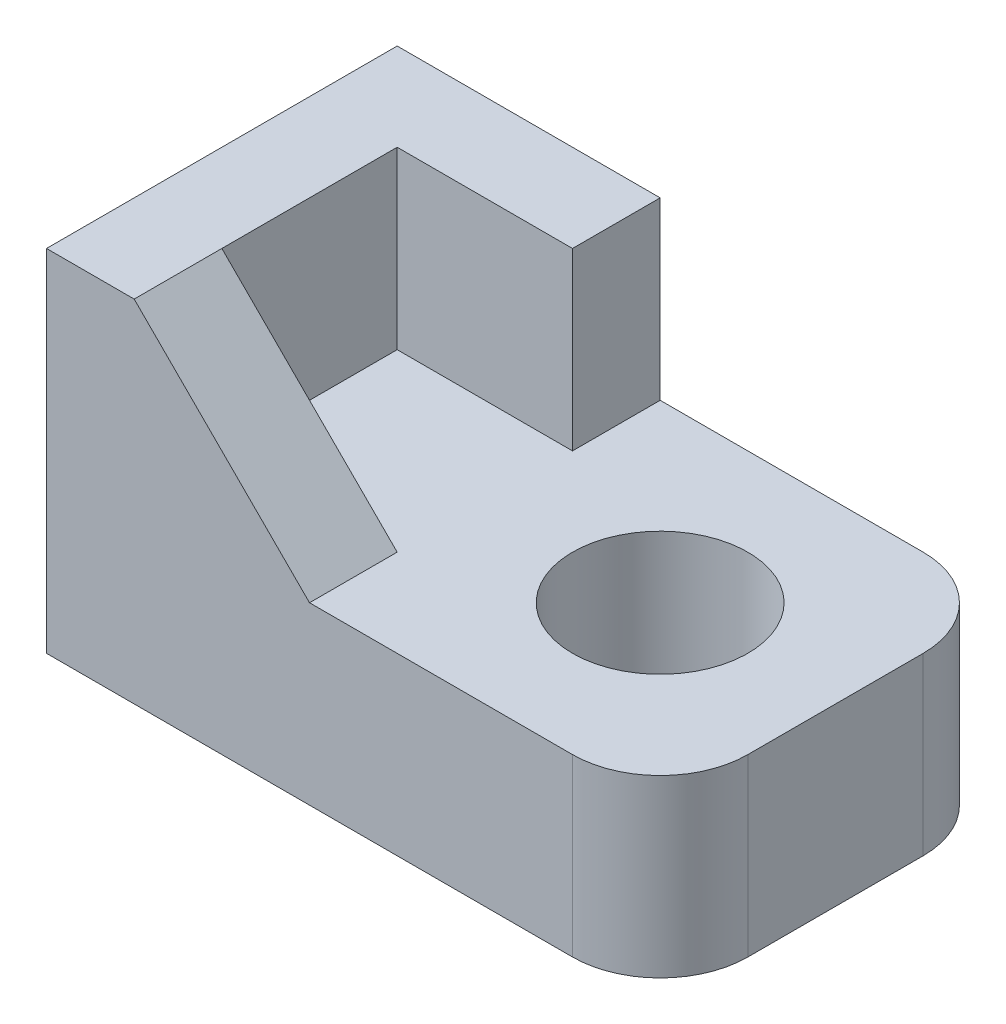
ISO-10303-21;
HEADER;
FILE_DESCRIPTION(('STEP AP214'),'2;1');
FILE_NAME('part.step','',(''),(''),'','','');
FILE_SCHEMA(('AUTOMOTIVE_DESIGN { 1 0 10303 214 1 1 1 1 }'));
ENDSEC;
DATA;
#1=APPLICATION_CONTEXT('core data for automotive mechanical design processes');
#2=APPLICATION_PROTOCOL_DEFINITION('international standard','automotive_design',2000,#1);
#3=PRODUCT_CONTEXT('',#1,'mechanical');
#4=PRODUCT('Part','Part','',(#3));
#5=PRODUCT_RELATED_PRODUCT_CATEGORY('part','',(#4));
#6=PRODUCT_DEFINITION_FORMATION('','',#4);
#7=PRODUCT_DEFINITION_CONTEXT('part definition',#1,'design');
#8=PRODUCT_DEFINITION('design','',#6,#7);
#9=PRODUCT_DEFINITION_SHAPE('','',#8);
#10=(LENGTH_UNIT() NAMED_UNIT(*) SI_UNIT(.MILLI.,.METRE.));
#11=(NAMED_UNIT(*) PLANE_ANGLE_UNIT() SI_UNIT($,.RADIAN.));
#12=(NAMED_UNIT(*) SI_UNIT($,.STERADIAN.) SOLID_ANGLE_UNIT());
#13=UNCERTAINTY_MEASURE_WITH_UNIT(LENGTH_MEASURE(1.E-05),#10,'distance_accuracy_value','');
#14=(GEOMETRIC_REPRESENTATION_CONTEXT(3) GLOBAL_UNCERTAINTY_ASSIGNED_CONTEXT((#13)) GLOBAL_UNIT_ASSIGNED_CONTEXT((#10,
#11,#12)) REPRESENTATION_CONTEXT('',''));
#15=CARTESIAN_POINT('',(0.,0.,0.));
#16=DIRECTION('',(0.,0.,1.));
#17=DIRECTION('',(1.,0.,0.));
#18=AXIS2_PLACEMENT_3D('',#15,#16,#17);
#19=CARTESIAN_POINT('',(30.,10.,-5.));
#20=DIRECTION('',(0.,1.,0.));
#21=DIRECTION('',(0.,0.,1.));
#22=AXIS2_PLACEMENT_3D('',#19,#20,#21);
#23=PLANE('',#22);
#24=DIRECTION('',(0.,0.,-1.));
#25=VECTOR('',#24,1.);
#26=CARTESIAN_POINT('',(15.,10.,-5.));
#27=LINE('',#26,#25);
#28=CARTESIAN_POINT('',(15.,10.,10.));
#29=VERTEX_POINT('',#28);
#30=CARTESIAN_POINT('',(15.,10.,5.));
#31=VERTEX_POINT('',#30);
#32=EDGE_CURVE('E117',#29,#31,#27,.T.);
#33=ORIENTED_EDGE('',*,*,#32,.F.);
#34=DIRECTION('',(1.,0.,0.));
#35=VECTOR('',#34,1.);
#36=CARTESIAN_POINT('',(0.,10.,10.));
#37=LINE('',#36,#35);
#38=CARTESIAN_POINT('',(30.,10.,10.));
#39=VERTEX_POINT('',#38);
#40=EDGE_CURVE('E150',#29,#39,#37,.T.);
#41=ORIENTED_EDGE('',*,*,#40,.T.);
#42=CARTESIAN_POINT('',(30.,10.,5.));
#43=DIRECTION('',(0.,1.,0.));
#44=DIRECTION('',(0.,0.,-1.));
#45=AXIS2_PLACEMENT_3D('',#42,#43,#44);
#46=CIRCLE('',#45,5.);
#47=CARTESIAN_POINT('',(35.,10.,4.99999999999996));
#48=VERTEX_POINT('',#47);
#49=EDGE_CURVE('E153',#39,#48,#46,.T.);
#50=ORIENTED_EDGE('',*,*,#49,.T.);
#51=DIRECTION('',(0.,0.,-1.));
#52=VECTOR('',#51,1.);
#53=CARTESIAN_POINT('',(35.,10.,0.));
#54=LINE('',#53,#52);
#55=CARTESIAN_POINT('',(35.,10.,-4.99999999999996));
#56=VERTEX_POINT('',#55);
#57=EDGE_CURVE('E155',#48,#56,#54,.T.);
#58=ORIENTED_EDGE('',*,*,#57,.T.);
#59=CARTESIAN_POINT('',(30.,10.,-5.));
#60=DIRECTION('',(0.,1.,0.));
#61=DIRECTION('',(0.,0.,1.));
#62=AXIS2_PLACEMENT_3D('',#59,#60,#61);
#63=CIRCLE('',#62,5.);
#64=CARTESIAN_POINT('',(30.,10.,-10.));
#65=VERTEX_POINT('',#64);
#66=EDGE_CURVE('E157',#56,#65,#63,.T.);
#67=ORIENTED_EDGE('',*,*,#66,.T.);
#68=DIRECTION('',(-1.,0.,0.));
#69=VECTOR('',#68,1.);
#70=CARTESIAN_POINT('',(0.,10.,-10.));
#71=LINE('',#70,#69);
#72=CARTESIAN_POINT('',(15.,10.,-10.));
#73=VERTEX_POINT('',#72);
#74=EDGE_CURVE('E148',#65,#73,#71,.T.);
#75=ORIENTED_EDGE('',*,*,#74,.T.);
#76=DIRECTION('',(0.,0.,-1.));
#77=VECTOR('',#76,1.);
#78=CARTESIAN_POINT('',(15.,10.,-5.));
#79=LINE('',#78,#77);
#80=CARTESIAN_POINT('',(15.,10.,-5.));
#81=VERTEX_POINT('',#80);
#82=EDGE_CURVE('E125',#81,#73,#79,.T.);
#83=ORIENTED_EDGE('',*,*,#82,.F.);
#84=DIRECTION('',(1.,0.,0.));
#85=VECTOR('',#84,1.);
#86=CARTESIAN_POINT('',(30.,10.,-5.));
#87=LINE('',#86,#85);
#88=CARTESIAN_POINT('',(5.,10.,-5.));
#89=VERTEX_POINT('',#88);
#90=EDGE_CURVE('E53',#89,#81,#87,.T.);
#91=ORIENTED_EDGE('',*,*,#90,.F.);
#92=DIRECTION('',(0.,0.,-1.));
#93=VECTOR('',#92,1.);
#94=CARTESIAN_POINT('',(5.,10.,-5.));
#95=LINE('',#94,#93);
#96=CARTESIAN_POINT('',(5.,10.,5.));
#97=VERTEX_POINT('',#96);
#98=EDGE_CURVE('E48',#97,#89,#95,.T.);
#99=ORIENTED_EDGE('',*,*,#98,.F.);
#100=DIRECTION('',(-1.,0.,0.));
#101=VECTOR('',#100,1.);
#102=CARTESIAN_POINT('',(30.,10.,5.));
#103=LINE('',#102,#101);
#104=EDGE_CURVE('E131',#31,#97,#103,.T.);
#105=ORIENTED_EDGE('',*,*,#104,.F.);
#106=EDGE_LOOP('',(#33,#41,#50,#58,#67,#75,#83,#91,#99,#105));
#107=FACE_BOUND('',#106,.T.);
#108=CARTESIAN_POINT('',(25.,10.,0.));
#109=DIRECTION('',(0.,1.,0.));
#110=DIRECTION('',(0.,0.,1.));
#111=AXIS2_PLACEMENT_3D('',#108,#109,#110);
#112=CIRCLE('',#111,5.);
#113=CARTESIAN_POINT('',(25.,10.,5.));
#114=VERTEX_POINT('',#113);
#115=EDGE_CURVE('E140',#114,#114,#112,.T.);
#116=ORIENTED_EDGE('',*,*,#115,.F.);
#117=EDGE_LOOP('',(#116));
#118=FACE_BOUND('',#117,.T.);
#119=ADVANCED_FACE('F33',(#107,#118),#23,.T.);
#120=CARTESIAN_POINT('',(30.,0.,-5.));
#121=DIRECTION('',(0.,1.,0.));
#122=DIRECTION('',(0.,0.,1.));
#123=AXIS2_PLACEMENT_3D('',#120,#121,#122);
#124=PLANE('',#123);
#125=CARTESIAN_POINT('',(30.,0.,5.));
#126=DIRECTION('',(0.,1.,0.));
#127=DIRECTION('',(0.,0.,-1.));
#128=AXIS2_PLACEMENT_3D('',#125,#126,#127);
#129=CIRCLE('',#128,5.);
#130=CARTESIAN_POINT('',(30.,0.,10.));
#131=VERTEX_POINT('',#130);
#132=CARTESIAN_POINT('',(35.,0.,4.99999999999996));
#133=VERTEX_POINT('',#132);
#134=EDGE_CURVE('E165',#131,#133,#129,.T.);
#135=ORIENTED_EDGE('',*,*,#134,.F.);
#136=DIRECTION('',(1.,0.,0.));
#137=VECTOR('',#136,1.);
#138=CARTESIAN_POINT('',(0.,0.,10.));
#139=LINE('',#138,#137);
#140=CARTESIAN_POINT('',(0.,0.,10.));
#141=VERTEX_POINT('',#140);
#142=EDGE_CURVE('E163',#141,#131,#139,.T.);
#143=ORIENTED_EDGE('',*,*,#142,.F.);
#144=DIRECTION('',(0.,0.,1.));
#145=VECTOR('',#144,1.);
#146=CARTESIAN_POINT('',(0.,0.,10.));
#147=LINE('',#146,#145);
#148=CARTESIAN_POINT('',(0.,0.,-10.));
#149=VERTEX_POINT('',#148);
#150=EDGE_CURVE('E161',#149,#141,#147,.T.);
#151=ORIENTED_EDGE('',*,*,#150,.F.);
#152=DIRECTION('',(-1.,0.,0.));
#153=VECTOR('',#152,1.);
#154=CARTESIAN_POINT('',(0.,0.,-10.));
#155=LINE('',#154,#153);
#156=CARTESIAN_POINT('',(30.,0.,-10.));
#157=VERTEX_POINT('',#156);
#158=EDGE_CURVE('E146',#157,#149,#155,.T.);
#159=ORIENTED_EDGE('',*,*,#158,.F.);
#160=CARTESIAN_POINT('',(30.,0.,-5.));
#161=DIRECTION('',(0.,1.,0.));
#162=DIRECTION('',(0.,0.,1.));
#163=AXIS2_PLACEMENT_3D('',#160,#161,#162);
#164=CIRCLE('',#163,5.);
#165=CARTESIAN_POINT('',(35.,0.,-4.99999999999996));
#166=VERTEX_POINT('',#165);
#167=EDGE_CURVE('E151',#166,#157,#164,.T.);
#168=ORIENTED_EDGE('',*,*,#167,.F.);
#169=DIRECTION('',(0.,0.,-1.));
#170=VECTOR('',#169,1.);
#171=CARTESIAN_POINT('',(35.,0.,-4.99999999999996));
#172=LINE('',#171,#170);
#173=EDGE_CURVE('E168',#133,#166,#172,.T.);
#174=ORIENTED_EDGE('',*,*,#173,.F.);
#175=EDGE_LOOP('',(#135,#143,#151,#159,#168,#174));
#176=FACE_BOUND('',#175,.T.);
#177=CARTESIAN_POINT('',(25.,0.,0.));
#178=DIRECTION('',(0.,1.,0.));
#179=DIRECTION('',(0.,0.,1.));
#180=AXIS2_PLACEMENT_3D('',#177,#178,#179);
#181=CIRCLE('',#180,5.);
#182=CARTESIAN_POINT('',(25.,0.,5.));
#183=VERTEX_POINT('',#182);
#184=EDGE_CURVE('E137',#183,#183,#181,.T.);
#185=ORIENTED_EDGE('',*,*,#184,.T.);
#186=EDGE_LOOP('',(#185));
#187=FACE_BOUND('',#186,.T.);
#188=ADVANCED_FACE('F195',(#176,#187),#124,.F.);
#189=CARTESIAN_POINT('',(0.,10.,-10.));
#190=DIRECTION('',(0.,0.,1.));
#191=DIRECTION('',(1.,0.,0.));
#192=AXIS2_PLACEMENT_3D('',#189,#190,#191);
#193=PLANE('',#192);
#194=ORIENTED_EDGE('',*,*,#158,.T.);
#195=DIRECTION('',(0.,-1.,0.));
#196=VECTOR('',#195,1.);
#197=CARTESIAN_POINT('',(0.,10.,-10.));
#198=LINE('',#197,#196);
#199=CARTESIAN_POINT('',(0.,20.,-10.));
#200=VERTEX_POINT('',#199);
#201=EDGE_CURVE('E11',#200,#149,#198,.T.);
#202=ORIENTED_EDGE('',*,*,#201,.F.);
#203=DIRECTION('',(1.,0.,0.));
#204=VECTOR('',#203,1.);
#205=CARTESIAN_POINT('',(0.,20.,-10.));
#206=LINE('',#205,#204);
#207=CARTESIAN_POINT('',(15.,20.,-10.));
#208=VERTEX_POINT('',#207);
#209=EDGE_CURVE('E216',#200,#208,#206,.T.);
#210=ORIENTED_EDGE('',*,*,#209,.T.);
#211=DIRECTION('',(0.,-1.,0.));
#212=VECTOR('',#211,1.);
#213=CARTESIAN_POINT('',(15.,20.,-10.));
#214=LINE('',#213,#212);
#215=EDGE_CURVE('E230',#208,#73,#214,.T.);
#216=ORIENTED_EDGE('',*,*,#215,.T.);
#217=ORIENTED_EDGE('',*,*,#74,.F.);
#218=DIRECTION('',(0.,-1.,0.));
#219=VECTOR('',#218,1.);
#220=CARTESIAN_POINT('',(30.,10.,-10.));
#221=LINE('',#220,#219);
#222=EDGE_CURVE('E159',#65,#157,#221,.T.);
#223=ORIENTED_EDGE('',*,*,#222,.T.);
#224=EDGE_LOOP('',(#194,#202,#210,#216,#217,#223));
#225=FACE_BOUND('',#224,.T.);
#226=ADVANCED_FACE('F35',(#225),#193,.F.);
#227=CARTESIAN_POINT('',(0.,10.,10.));
#228=DIRECTION('',(1.,0.,0.));
#229=DIRECTION('',(0.,0.,-1.));
#230=AXIS2_PLACEMENT_3D('',#227,#228,#229);
#231=PLANE('',#230);
#232=ORIENTED_EDGE('',*,*,#150,.T.);
#233=DIRECTION('',(0.,-1.,0.));
#234=VECTOR('',#233,1.);
#235=CARTESIAN_POINT('',(0.,10.,10.));
#236=LINE('',#235,#234);
#237=CARTESIAN_POINT('',(0.,20.,10.));
#238=VERTEX_POINT('',#237);
#239=EDGE_CURVE('E41',#238,#141,#236,.T.);
#240=ORIENTED_EDGE('',*,*,#239,.F.);
#241=DIRECTION('',(0.,0.,-1.));
#242=VECTOR('',#241,1.);
#243=CARTESIAN_POINT('',(0.,20.,10.));
#244=LINE('',#243,#242);
#245=EDGE_CURVE('E214',#238,#200,#244,.T.);
#246=ORIENTED_EDGE('',*,*,#245,.T.);
#247=ORIENTED_EDGE('',*,*,#201,.T.);
#248=EDGE_LOOP('',(#232,#240,#246,#247));
#249=FACE_BOUND('',#248,.T.);
#250=ADVANCED_FACE('F249',(#249),#231,.F.);
#251=CARTESIAN_POINT('',(0.,10.,10.));
#252=DIRECTION('',(0.,0.,-1.));
#253=DIRECTION('',(-1.,0.,0.));
#254=AXIS2_PLACEMENT_3D('',#251,#252,#253);
#255=PLANE('',#254);
#256=ORIENTED_EDGE('',*,*,#40,.F.);
#257=DIRECTION('',(0.707106781186548,-0.707106781186548,0.));
#258=VECTOR('',#257,1.);
#259=CARTESIAN_POINT('',(15.,10.,10.));
#260=LINE('',#259,#258);
#261=CARTESIAN_POINT('',(5.,20.,10.));
#262=VERTEX_POINT('',#261);
#263=EDGE_CURVE('E123',#262,#29,#260,.T.);
#264=ORIENTED_EDGE('',*,*,#263,.F.);
#265=DIRECTION('',(-1.,0.,0.));
#266=VECTOR('',#265,1.);
#267=CARTESIAN_POINT('',(15.,20.,10.));
#268=LINE('',#267,#266);
#269=EDGE_CURVE('E188',#262,#238,#268,.T.);
#270=ORIENTED_EDGE('',*,*,#269,.T.);
#271=ORIENTED_EDGE('',*,*,#239,.T.);
#272=ORIENTED_EDGE('',*,*,#142,.T.);
#273=DIRECTION('',(0.,-1.,0.));
#274=VECTOR('',#273,1.);
#275=CARTESIAN_POINT('',(30.,10.,10.));
#276=LINE('',#275,#274);
#277=EDGE_CURVE('E179',#39,#131,#276,.T.);
#278=ORIENTED_EDGE('',*,*,#277,.F.);
#279=EDGE_LOOP('',(#256,#264,#270,#271,#272,#278));
#280=FACE_BOUND('',#279,.T.);
#281=ADVANCED_FACE('F185',(#280),#255,.F.);
#282=CARTESIAN_POINT('',(30.,10.,5.));
#283=DIRECTION('',(0.,-1.,0.));
#284=DIRECTION('',(0.,0.,-1.));
#285=AXIS2_PLACEMENT_3D('',#282,#283,#284);
#286=CYLINDRICAL_SURFACE('',#285,5.);
#287=ORIENTED_EDGE('',*,*,#134,.T.);
#288=DIRECTION('',(0.,-1.,0.));
#289=VECTOR('',#288,1.);
#290=CARTESIAN_POINT('',(35.,10.,4.99999999999996));
#291=LINE('',#290,#289);
#292=EDGE_CURVE('E176',#48,#133,#291,.T.);
#293=ORIENTED_EDGE('',*,*,#292,.F.);
#294=ORIENTED_EDGE('',*,*,#49,.F.);
#295=ORIENTED_EDGE('',*,*,#277,.T.);
#296=EDGE_LOOP('',(#287,#293,#294,#295));
#297=FACE_BOUND('',#296,.T.);
#298=ADVANCED_FACE('F201',(#297),#286,.T.);
#299=CARTESIAN_POINT('',(35.,10.,-4.99999999999996));
#300=DIRECTION('',(-1.,0.,0.));
#301=DIRECTION('',(0.,0.,1.));
#302=AXIS2_PLACEMENT_3D('',#299,#300,#301);
#303=PLANE('',#302);
#304=ORIENTED_EDGE('',*,*,#173,.T.);
#305=DIRECTION('',(0.,-1.,0.));
#306=VECTOR('',#305,1.);
#307=CARTESIAN_POINT('',(35.,10.,-4.99999999999996));
#308=LINE('',#307,#306);
#309=EDGE_CURVE('E173',#56,#166,#308,.T.);
#310=ORIENTED_EDGE('',*,*,#309,.F.);
#311=ORIENTED_EDGE('',*,*,#57,.F.);
#312=ORIENTED_EDGE('',*,*,#292,.T.);
#313=EDGE_LOOP('',(#304,#310,#311,#312));
#314=FACE_BOUND('',#313,.T.);
#315=ADVANCED_FACE('F205',(#314),#303,.F.);
#316=CARTESIAN_POINT('',(30.,10.,-5.));
#317=DIRECTION('',(0.,-1.,0.));
#318=DIRECTION('',(0.,0.,-1.));
#319=AXIS2_PLACEMENT_3D('',#316,#317,#318);
#320=CYLINDRICAL_SURFACE('',#319,5.);
#321=ORIENTED_EDGE('',*,*,#167,.T.);
#322=ORIENTED_EDGE('',*,*,#222,.F.);
#323=ORIENTED_EDGE('',*,*,#66,.F.);
#324=ORIENTED_EDGE('',*,*,#309,.T.);
#325=EDGE_LOOP('',(#321,#322,#323,#324));
#326=FACE_BOUND('',#325,.T.);
#327=ADVANCED_FACE('F266',(#326),#320,.T.);
#328=CARTESIAN_POINT('',(25.,10.,0.));
#329=DIRECTION('',(0.,-1.,0.));
#330=DIRECTION('',(0.,0.,-1.));
#331=AXIS2_PLACEMENT_3D('',#328,#329,#330);
#332=CYLINDRICAL_SURFACE('',#331,5.);
#333=ORIENTED_EDGE('',*,*,#115,.T.);
#334=EDGE_LOOP('',(#333));
#335=FACE_BOUND('',#334,.T.);
#336=ORIENTED_EDGE('',*,*,#184,.F.);
#337=EDGE_LOOP('',(#336));
#338=FACE_BOUND('',#337,.T.);
#339=ADVANCED_FACE('F263',(#335,#338),#332,.F.);
#340=CARTESIAN_POINT('',(5.,20.,5.));
#341=DIRECTION('',(0.,0.,-1.));
#342=DIRECTION('',(-1.,0.,0.));
#343=AXIS2_PLACEMENT_3D('',#340,#341,#342);
#344=PLANE('',#343);
#345=DIRECTION('',(0.707106781186548,-0.707106781186548,0.));
#346=VECTOR('',#345,1.);
#347=CARTESIAN_POINT('',(15.,10.,5.));
#348=LINE('',#347,#346);
#349=CARTESIAN_POINT('',(5.,20.,5.));
#350=VERTEX_POINT('',#349);
#351=EDGE_CURVE('E120',#350,#31,#348,.T.);
#352=ORIENTED_EDGE('',*,*,#351,.T.);
#353=ORIENTED_EDGE('',*,*,#104,.T.);
#354=DIRECTION('',(0.,-1.,0.));
#355=VECTOR('',#354,1.);
#356=CARTESIAN_POINT('',(5.,20.,5.));
#357=LINE('',#356,#355);
#358=EDGE_CURVE('E126',#350,#97,#357,.T.);
#359=ORIENTED_EDGE('',*,*,#358,.F.);
#360=EDGE_LOOP('',(#352,#353,#359));
#361=FACE_BOUND('',#360,.T.);
#362=ADVANCED_FACE('F130',(#361),#344,.T.);
#363=CARTESIAN_POINT('',(5.,20.,-5.));
#364=DIRECTION('',(1.,0.,0.));
#365=DIRECTION('',(0.,0.,-1.));
#366=AXIS2_PLACEMENT_3D('',#363,#364,#365);
#367=PLANE('',#366);
#368=ORIENTED_EDGE('',*,*,#358,.T.);
#369=ORIENTED_EDGE('',*,*,#98,.T.);
#370=DIRECTION('',(0.,-1.,0.));
#371=VECTOR('',#370,1.);
#372=CARTESIAN_POINT('',(5.,20.,-5.));
#373=LINE('',#372,#371);
#374=CARTESIAN_POINT('',(5.,20.,-5.));
#375=VERTEX_POINT('',#374);
#376=EDGE_CURVE('E232',#375,#89,#373,.T.);
#377=ORIENTED_EDGE('',*,*,#376,.F.);
#378=DIRECTION('',(0.,0.,1.));
#379=VECTOR('',#378,1.);
#380=CARTESIAN_POINT('',(5.,20.,-5.));
#381=LINE('',#380,#379);
#382=EDGE_CURVE('E228',#375,#350,#381,.T.);
#383=ORIENTED_EDGE('',*,*,#382,.T.);
#384=EDGE_LOOP('',(#368,#369,#377,#383));
#385=FACE_BOUND('',#384,.T.);
#386=ADVANCED_FACE('F298',(#385),#367,.T.);
#387=CARTESIAN_POINT('',(15.,20.,-5.));
#388=DIRECTION('',(0.,0.,1.));
#389=DIRECTION('',(1.,0.,0.));
#390=AXIS2_PLACEMENT_3D('',#387,#388,#389);
#391=PLANE('',#390);
#392=ORIENTED_EDGE('',*,*,#376,.T.);
#393=ORIENTED_EDGE('',*,*,#90,.T.);
#394=DIRECTION('',(0.,-1.,0.));
#395=VECTOR('',#394,1.);
#396=CARTESIAN_POINT('',(15.,20.,-5.));
#397=LINE('',#396,#395);
#398=CARTESIAN_POINT('',(15.,20.,-5.));
#399=VERTEX_POINT('',#398);
#400=EDGE_CURVE('E235',#399,#81,#397,.T.);
#401=ORIENTED_EDGE('',*,*,#400,.F.);
#402=DIRECTION('',(-1.,0.,0.));
#403=VECTOR('',#402,1.);
#404=CARTESIAN_POINT('',(15.,20.,-5.));
#405=LINE('',#404,#403);
#406=EDGE_CURVE('E225',#399,#375,#405,.T.);
#407=ORIENTED_EDGE('',*,*,#406,.T.);
#408=EDGE_LOOP('',(#392,#393,#401,#407));
#409=FACE_BOUND('',#408,.T.);
#410=ADVANCED_FACE('F242',(#409),#391,.T.);
#411=CARTESIAN_POINT('',(15.,20.,-10.));
#412=DIRECTION('',(1.,0.,0.));
#413=DIRECTION('',(0.,0.,-1.));
#414=AXIS2_PLACEMENT_3D('',#411,#412,#413);
#415=PLANE('',#414);
#416=ORIENTED_EDGE('',*,*,#400,.T.);
#417=ORIENTED_EDGE('',*,*,#82,.T.);
#418=ORIENTED_EDGE('',*,*,#215,.F.);
#419=DIRECTION('',(0.,0.,1.));
#420=VECTOR('',#419,1.);
#421=CARTESIAN_POINT('',(15.,20.,-10.));
#422=LINE('',#421,#420);
#423=EDGE_CURVE('E222',#208,#399,#422,.T.);
#424=ORIENTED_EDGE('',*,*,#423,.T.);
#425=EDGE_LOOP('',(#416,#417,#418,#424));
#426=FACE_BOUND('',#425,.T.);
#427=ADVANCED_FACE('F245',(#426),#415,.T.);
#428=CARTESIAN_POINT('',(0.,20.,0.));
#429=DIRECTION('',(0.,-1.,0.));
#430=DIRECTION('',(0.,0.,-1.));
#431=AXIS2_PLACEMENT_3D('',#428,#429,#430);
#432=PLANE('',#431);
#433=ORIENTED_EDGE('',*,*,#269,.F.);
#434=DIRECTION('',(0.,0.,1.));
#435=VECTOR('',#434,1.);
#436=CARTESIAN_POINT('',(5.,20.,5.));
#437=LINE('',#436,#435);
#438=EDGE_CURVE('E134',#350,#262,#437,.T.);
#439=ORIENTED_EDGE('',*,*,#438,.F.);
#440=ORIENTED_EDGE('',*,*,#382,.F.);
#441=ORIENTED_EDGE('',*,*,#406,.F.);
#442=ORIENTED_EDGE('',*,*,#423,.F.);
#443=ORIENTED_EDGE('',*,*,#209,.F.);
#444=ORIENTED_EDGE('',*,*,#245,.F.);
#445=EDGE_LOOP('',(#433,#439,#440,#441,#442,#443,#444));
#446=FACE_BOUND('',#445,.T.);
#447=ADVANCED_FACE('F211',(#446),#432,.F.);
#448=CARTESIAN_POINT('',(15.,10.,5.));
#449=DIRECTION('',(-0.707106781186548,-0.707106781186548,0.));
#450=DIRECTION('',(0.707106781186548,-0.707106781186548,0.));
#451=AXIS2_PLACEMENT_3D('',#448,#449,#450);
#452=PLANE('',#451);
#453=ORIENTED_EDGE('',*,*,#263,.T.);
#454=ORIENTED_EDGE('',*,*,#32,.T.);
#455=ORIENTED_EDGE('',*,*,#351,.F.);
#456=ORIENTED_EDGE('',*,*,#438,.T.);
#457=EDGE_LOOP('',(#453,#454,#455,#456));
#458=FACE_BOUND('',#457,.T.);
#459=ADVANCED_FACE('F119',(#458),#452,.F.);
#460=CLOSED_SHELL('',(#119,#188,#226,#250,#281,#298,#315,#327,#339,#362,#386,#410,#427,#447,#459));
#461=MANIFOLD_SOLID_BREP('B2',#460);
#462=ADVANCED_BREP_SHAPE_REPRESENTATION('',(#18,#461),#14);
#463=SHAPE_DEFINITION_REPRESENTATION(#9,#462);
ENDSEC;
END-ISO-10303-21;
